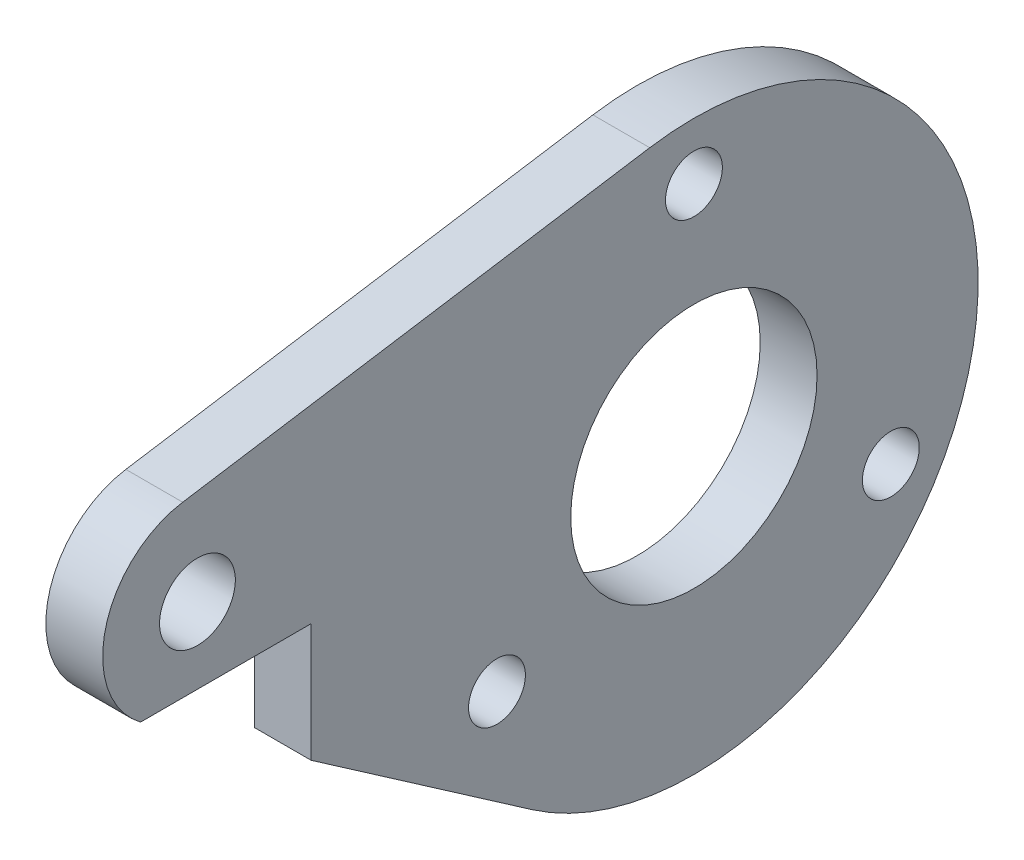
ISO-10303-21;
HEADER;
FILE_DESCRIPTION(('STEP AP214'),'2;1');
FILE_NAME('part.step','',(''),(''),'','','');
FILE_SCHEMA(('AUTOMOTIVE_DESIGN { 1 0 10303 214 1 1 1 1 }'));
ENDSEC;
DATA;
#1=APPLICATION_CONTEXT('core data for automotive mechanical design processes');
#2=APPLICATION_PROTOCOL_DEFINITION('international standard','automotive_design',2000,#1);
#3=PRODUCT_CONTEXT('',#1,'mechanical');
#4=PRODUCT('Part','Part','',(#3));
#5=PRODUCT_RELATED_PRODUCT_CATEGORY('part','',(#4));
#6=PRODUCT_DEFINITION_FORMATION('','',#4);
#7=PRODUCT_DEFINITION_CONTEXT('part definition',#1,'design');
#8=PRODUCT_DEFINITION('design','',#6,#7);
#9=PRODUCT_DEFINITION_SHAPE('','',#8);
#10=(LENGTH_UNIT() NAMED_UNIT(*) SI_UNIT(.MILLI.,.METRE.));
#11=(NAMED_UNIT(*) PLANE_ANGLE_UNIT() SI_UNIT($,.RADIAN.));
#12=(NAMED_UNIT(*) SI_UNIT($,.STERADIAN.) SOLID_ANGLE_UNIT());
#13=UNCERTAINTY_MEASURE_WITH_UNIT(LENGTH_MEASURE(1.E-05),#10,'distance_accuracy_value','');
#14=(GEOMETRIC_REPRESENTATION_CONTEXT(3) GLOBAL_UNCERTAINTY_ASSIGNED_CONTEXT((#13)) GLOBAL_UNIT_ASSIGNED_CONTEXT((#10,
#11,#12)) REPRESENTATION_CONTEXT('',''));
#15=CARTESIAN_POINT('',(0.,0.,0.));
#16=DIRECTION('',(0.,0.,1.));
#17=DIRECTION('',(1.,0.,0.));
#18=AXIS2_PLACEMENT_3D('',#15,#16,#17);
#19=CARTESIAN_POINT('',(3.,5.99999999999995,26.2));
#20=DIRECTION('',(-1.,0.,0.));
#21=DIRECTION('',(0.,0.,1.));
#22=AXIS2_PLACEMENT_3D('',#19,#20,#21);
#23=CYLINDRICAL_SURFACE('',#22,5.);
#24=DIRECTION('',(-1.,0.,0.));
#25=VECTOR('',#24,1.);
#26=CARTESIAN_POINT('',(3.,1.99999999999998,29.2));
#27=LINE('',#26,#25);
#28=CARTESIAN_POINT('',(3.,1.99999999999998,29.2));
#29=VERTEX_POINT('',#28);
#30=CARTESIAN_POINT('',(0.,1.99999999999998,29.2));
#31=VERTEX_POINT('',#30);
#32=EDGE_CURVE('E177',#29,#31,#27,.T.);
#33=ORIENTED_EDGE('',*,*,#32,.F.);
#34=CARTESIAN_POINT('',(3.,5.99999999999995,26.2));
#35=DIRECTION('',(-1.,0.,0.));
#36=DIRECTION('',(0.,0.,-1.));
#37=AXIS2_PLACEMENT_3D('',#34,#35,#36);
#38=CIRCLE('',#37,5.);
#39=CARTESIAN_POINT('',(3.,10.9392142153328,26.9772791873283));
#40=VERTEX_POINT('',#39);
#41=EDGE_CURVE('E90',#29,#40,#38,.T.);
#42=ORIENTED_EDGE('',*,*,#41,.T.);
#43=DIRECTION('',(-1.,0.,0.));
#44=VECTOR('',#43,1.);
#45=CARTESIAN_POINT('',(3.,10.9392142153328,26.9772791873283));
#46=LINE('',#45,#44);
#47=CARTESIAN_POINT('',(0.,10.9392142153328,26.9772791873283));
#48=VERTEX_POINT('',#47);
#49=EDGE_CURVE('E48',#40,#48,#46,.T.);
#50=ORIENTED_EDGE('',*,*,#49,.T.);
#51=CARTESIAN_POINT('',(0.,5.99999999999995,26.2));
#52=DIRECTION('',(-1.,0.,0.));
#53=DIRECTION('',(0.,0.,-1.));
#54=AXIS2_PLACEMENT_3D('',#51,#52,#53);
#55=CIRCLE('',#54,5.);
#56=EDGE_CURVE('E140',#31,#48,#55,.T.);
#57=ORIENTED_EDGE('',*,*,#56,.F.);
#58=EDGE_LOOP('',(#33,#42,#50,#57));
#59=FACE_BOUND('',#58,.T.);
#60=ADVANCED_FACE('F45',(#59),#23,.T.);
#61=CARTESIAN_POINT('',(3.,1.89130458207587,29.0493195613566));
#62=DIRECTION('',(0.,-0.821739083584816,0.569863912271331));
#63=DIRECTION('',(0.,-0.569863912271331,-0.821739083584816));
#64=AXIS2_PLACEMENT_3D('',#61,#62,#63);
#65=PLANE('',#64);
#66=DIRECTION('',(1.,0.,0.));
#67=VECTOR('',#66,1.);
#68=CARTESIAN_POINT('',(0.,-4.24556777426181,20.2));
#69=LINE('',#68,#67);
#70=CARTESIAN_POINT('',(0.,-4.24556777426181,20.2));
#71=VERTEX_POINT('',#70);
#72=CARTESIAN_POINT('',(3.,-4.24556777426181,20.2));
#73=VERTEX_POINT('',#72);
#74=EDGE_CURVE('E110',#71,#73,#69,.T.);
#75=ORIENTED_EDGE('',*,*,#74,.F.);
#76=DIRECTION('',(0.,0.569863912271331,0.821739083584816));
#77=VECTOR('',#76,1.);
#78=CARTESIAN_POINT('',(0.,1.89130458207587,29.0493195613566));
#79=LINE('',#78,#77);
#80=CARTESIAN_POINT('',(0.,-12.3260862537722,8.54795868406996));
#81=VERTEX_POINT('',#80);
#82=EDGE_CURVE('E118',#81,#71,#79,.T.);
#83=ORIENTED_EDGE('',*,*,#82,.F.);
#84=DIRECTION('',(-1.,0.,0.));
#85=VECTOR('',#84,1.);
#86=CARTESIAN_POINT('',(3.,-12.3260862537722,8.54795868406996));
#87=LINE('',#86,#85);
#88=CARTESIAN_POINT('',(3.,-12.3260862537722,8.54795868406996));
#89=VERTEX_POINT('',#88);
#90=EDGE_CURVE('E13',#89,#81,#87,.T.);
#91=ORIENTED_EDGE('',*,*,#90,.F.);
#92=DIRECTION('',(0.,0.569863912271331,0.821739083584816));
#93=VECTOR('',#92,1.);
#94=CARTESIAN_POINT('',(3.,1.89130458207587,29.0493195613566));
#95=LINE('',#94,#93);
#96=EDGE_CURVE('E120',#89,#73,#95,.T.);
#97=ORIENTED_EDGE('',*,*,#96,.T.);
#98=EDGE_LOOP('',(#75,#83,#91,#97));
#99=FACE_BOUND('',#98,.T.);
#100=ADVANCED_FACE('F117',(#99),#65,.T.);
#101=CARTESIAN_POINT('',(3.,0.,0.));
#102=DIRECTION('',(-1.,0.,0.));
#103=DIRECTION('',(0.,0.,1.));
#104=AXIS2_PLACEMENT_3D('',#101,#102,#103);
#105=CYLINDRICAL_SURFACE('',#104,15.);
#106=CARTESIAN_POINT('',(0.,0.,0.));
#107=DIRECTION('',(-1.,0.,0.));
#108=DIRECTION('',(0.,0.,-1.));
#109=AXIS2_PLACEMENT_3D('',#106,#107,#108);
#110=CIRCLE('',#109,15.);
#111=CARTESIAN_POINT('',(0.,14.8176426459986,2.3318375619851));
#112=VERTEX_POINT('',#111);
#113=EDGE_CURVE('E124',#112,#81,#110,.T.);
#114=ORIENTED_EDGE('',*,*,#113,.F.);
#115=DIRECTION('',(-1.,0.,0.));
#116=VECTOR('',#115,1.);
#117=CARTESIAN_POINT('',(3.,14.8176426459986,2.3318375619851));
#118=LINE('',#117,#116);
#119=CARTESIAN_POINT('',(3.,14.8176426459986,2.3318375619851));
#120=VERTEX_POINT('',#119);
#121=EDGE_CURVE('E53',#120,#112,#118,.T.);
#122=ORIENTED_EDGE('',*,*,#121,.F.);
#123=CARTESIAN_POINT('',(3.,0.,0.));
#124=DIRECTION('',(-1.,0.,0.));
#125=DIRECTION('',(0.,0.,-1.));
#126=AXIS2_PLACEMENT_3D('',#123,#124,#125);
#127=CIRCLE('',#126,15.);
#128=EDGE_CURVE('E135',#120,#89,#127,.T.);
#129=ORIENTED_EDGE('',*,*,#128,.T.);
#130=ORIENTED_EDGE('',*,*,#90,.T.);
#131=EDGE_LOOP('',(#114,#122,#129,#130));
#132=FACE_BOUND('',#131,.T.);
#133=ADVANCED_FACE('F201',(#132),#105,.T.);
#134=CARTESIAN_POINT('',(3.,14.8176426459986,2.33183756198509));
#135=DIRECTION('',(0.,0.987842843066571,0.155455837465673));
#136=DIRECTION('',(0.,-0.155455837465673,0.987842843066571));
#137=AXIS2_PLACEMENT_3D('',#134,#135,#136);
#138=PLANE('',#137);
#139=DIRECTION('',(0.,0.155455837465673,-0.987842843066571));
#140=VECTOR('',#139,1.);
#141=CARTESIAN_POINT('',(0.,14.8176426459986,2.33183756198509));
#142=LINE('',#141,#140);
#143=EDGE_CURVE('E128',#48,#112,#142,.T.);
#144=ORIENTED_EDGE('',*,*,#143,.F.);
#145=ORIENTED_EDGE('',*,*,#49,.F.);
#146=DIRECTION('',(0.,0.155455837465673,-0.987842843066571));
#147=VECTOR('',#146,1.);
#148=CARTESIAN_POINT('',(3.,14.8176426459986,2.33183756198509));
#149=LINE('',#148,#147);
#150=EDGE_CURVE('E126',#40,#120,#149,.T.);
#151=ORIENTED_EDGE('',*,*,#150,.T.);
#152=ORIENTED_EDGE('',*,*,#121,.T.);
#153=EDGE_LOOP('',(#144,#145,#151,#152));
#154=FACE_BOUND('',#153,.T.);
#155=ADVANCED_FACE('F142',(#154),#138,.T.);
#156=CARTESIAN_POINT('',(3.,5.99999999999995,26.2));
#157=DIRECTION('',(1.,0.,0.));
#158=DIRECTION('',(0.,0.,-1.));
#159=AXIS2_PLACEMENT_3D('',#156,#157,#158);
#160=PLANE('',#159);
#161=DIRECTION('',(0.,0.,1.));
#162=VECTOR('',#161,1.);
#163=CARTESIAN_POINT('',(3.,1.99999999999998,29.206057461742));
#164=LINE('',#163,#162);
#165=CARTESIAN_POINT('',(3.,1.99999999999998,20.2));
#166=VERTEX_POINT('',#165);
#167=EDGE_CURVE('E115',#166,#29,#164,.T.);
#168=ORIENTED_EDGE('',*,*,#167,.F.);
#169=DIRECTION('',(0.,1.,0.));
#170=VECTOR('',#169,1.);
#171=CARTESIAN_POINT('',(3.,1.99999999999998,20.2));
#172=LINE('',#171,#170);
#173=EDGE_CURVE('E183',#73,#166,#172,.T.);
#174=ORIENTED_EDGE('',*,*,#173,.F.);
#175=ORIENTED_EDGE('',*,*,#96,.F.);
#176=ORIENTED_EDGE('',*,*,#128,.F.);
#177=ORIENTED_EDGE('',*,*,#150,.F.);
#178=ORIENTED_EDGE('',*,*,#41,.F.);
#179=EDGE_LOOP('',(#168,#174,#175,#176,#177,#178));
#180=FACE_BOUND('',#179,.T.);
#181=CARTESIAN_POINT('',(3.,5.99999999999995,26.2));
#182=DIRECTION('',(-1.,0.,0.));
#183=DIRECTION('',(0.,0.,1.));
#184=AXIS2_PLACEMENT_3D('',#181,#182,#183);
#185=CIRCLE('',#184,2.);
#186=CARTESIAN_POINT('',(3.,5.99999999999995,28.2));
#187=VERTEX_POINT('',#186);
#188=EDGE_CURVE('E171',#187,#187,#185,.T.);
#189=ORIENTED_EDGE('',*,*,#188,.T.);
#190=EDGE_LOOP('',(#189));
#191=FACE_BOUND('',#190,.T.);
#192=CARTESIAN_POINT('',(3.,-6.00000000000003,-10.3923048454132));
#193=DIRECTION('',(-1.,0.,0.));
#194=DIRECTION('',(0.,0.,1.));
#195=AXIS2_PLACEMENT_3D('',#192,#193,#194);
#196=CIRCLE('',#195,1.5);
#197=CARTESIAN_POINT('',(3.,-6.00000000000003,-8.89230484541321));
#198=VERTEX_POINT('',#197);
#199=EDGE_CURVE('E165',#198,#198,#196,.T.);
#200=ORIENTED_EDGE('',*,*,#199,.T.);
#201=EDGE_LOOP('',(#200));
#202=FACE_BOUND('',#201,.T.);
#203=CARTESIAN_POINT('',(3.,12.,0.));
#204=DIRECTION('',(-1.,0.,0.));
#205=DIRECTION('',(0.,0.,1.));
#206=AXIS2_PLACEMENT_3D('',#203,#204,#205);
#207=CIRCLE('',#206,1.5);
#208=CARTESIAN_POINT('',(3.,12.,1.5));
#209=VERTEX_POINT('',#208);
#210=EDGE_CURVE('E159',#209,#209,#207,.T.);
#211=ORIENTED_EDGE('',*,*,#210,.T.);
#212=EDGE_LOOP('',(#211));
#213=FACE_BOUND('',#212,.T.);
#214=CARTESIAN_POINT('',(3.,-6.00000000000005,10.3923048454132));
#215=DIRECTION('',(-1.,0.,0.));
#216=DIRECTION('',(0.,0.,1.));
#217=AXIS2_PLACEMENT_3D('',#214,#215,#216);
#218=CIRCLE('',#217,1.5);
#219=CARTESIAN_POINT('',(3.,-6.00000000000005,11.8923048454132));
#220=VERTEX_POINT('',#219);
#221=EDGE_CURVE('E153',#220,#220,#218,.T.);
#222=ORIENTED_EDGE('',*,*,#221,.T.);
#223=EDGE_LOOP('',(#222));
#224=FACE_BOUND('',#223,.T.);
#225=CARTESIAN_POINT('',(3.,0.,0.));
#226=DIRECTION('',(-1.,0.,0.));
#227=DIRECTION('',(0.,0.,1.));
#228=AXIS2_PLACEMENT_3D('',#225,#226,#227);
#229=CIRCLE('',#228,6.5);
#230=CARTESIAN_POINT('',(3.,0.,6.5));
#231=VERTEX_POINT('',#230);
#232=EDGE_CURVE('E141',#231,#231,#229,.T.);
#233=ORIENTED_EDGE('',*,*,#232,.T.);
#234=EDGE_LOOP('',(#233));
#235=FACE_BOUND('',#234,.T.);
#236=ADVANCED_FACE('F147',(#180,#191,#202,#213,#224,#235),#160,.T.);
#237=CARTESIAN_POINT('',(0.,5.99999999999995,26.2));
#238=DIRECTION('',(1.,0.,0.));
#239=DIRECTION('',(0.,0.,-1.));
#240=AXIS2_PLACEMENT_3D('',#237,#238,#239);
#241=PLANE('',#240);
#242=CARTESIAN_POINT('',(0.,5.99999999999995,26.2));
#243=DIRECTION('',(-1.,0.,0.));
#244=DIRECTION('',(0.,0.,1.));
#245=AXIS2_PLACEMENT_3D('',#242,#243,#244);
#246=CIRCLE('',#245,2.);
#247=CARTESIAN_POINT('',(0.,5.99999999999995,28.2));
#248=VERTEX_POINT('',#247);
#249=EDGE_CURVE('E174',#248,#248,#246,.T.);
#250=ORIENTED_EDGE('',*,*,#249,.F.);
#251=EDGE_LOOP('',(#250));
#252=FACE_BOUND('',#251,.T.);
#253=CARTESIAN_POINT('',(0.,-6.00000000000003,-10.3923048454132));
#254=DIRECTION('',(-1.,0.,0.));
#255=DIRECTION('',(0.,0.,1.));
#256=AXIS2_PLACEMENT_3D('',#253,#254,#255);
#257=CIRCLE('',#256,1.5);
#258=CARTESIAN_POINT('',(0.,-6.00000000000003,-8.89230484541321));
#259=VERTEX_POINT('',#258);
#260=EDGE_CURVE('E168',#259,#259,#257,.T.);
#261=ORIENTED_EDGE('',*,*,#260,.F.);
#262=EDGE_LOOP('',(#261));
#263=FACE_BOUND('',#262,.T.);
#264=CARTESIAN_POINT('',(0.,12.,0.));
#265=DIRECTION('',(-1.,0.,0.));
#266=DIRECTION('',(0.,0.,1.));
#267=AXIS2_PLACEMENT_3D('',#264,#265,#266);
#268=CIRCLE('',#267,1.5);
#269=CARTESIAN_POINT('',(0.,12.,1.5));
#270=VERTEX_POINT('',#269);
#271=EDGE_CURVE('E162',#270,#270,#268,.T.);
#272=ORIENTED_EDGE('',*,*,#271,.F.);
#273=EDGE_LOOP('',(#272));
#274=FACE_BOUND('',#273,.T.);
#275=CARTESIAN_POINT('',(0.,-6.00000000000005,10.3923048454132));
#276=DIRECTION('',(-1.,0.,0.));
#277=DIRECTION('',(0.,0.,1.));
#278=AXIS2_PLACEMENT_3D('',#275,#276,#277);
#279=CIRCLE('',#278,1.5);
#280=CARTESIAN_POINT('',(0.,-6.00000000000005,11.8923048454132));
#281=VERTEX_POINT('',#280);
#282=EDGE_CURVE('E156',#281,#281,#279,.T.);
#283=ORIENTED_EDGE('',*,*,#282,.F.);
#284=EDGE_LOOP('',(#283));
#285=FACE_BOUND('',#284,.T.);
#286=CARTESIAN_POINT('',(0.,0.,0.));
#287=DIRECTION('',(-1.,0.,0.));
#288=DIRECTION('',(0.,0.,1.));
#289=AXIS2_PLACEMENT_3D('',#286,#287,#288);
#290=CIRCLE('',#289,6.5);
#291=CARTESIAN_POINT('',(0.,0.,6.5));
#292=VERTEX_POINT('',#291);
#293=EDGE_CURVE('E150',#292,#292,#290,.T.);
#294=ORIENTED_EDGE('',*,*,#293,.F.);
#295=EDGE_LOOP('',(#294));
#296=FACE_BOUND('',#295,.T.);
#297=DIRECTION('',(0.,1.,0.));
#298=VECTOR('',#297,1.);
#299=CARTESIAN_POINT('',(0.,1.99999999999998,20.2));
#300=LINE('',#299,#298);
#301=CARTESIAN_POINT('',(0.,1.99999999999998,20.2));
#302=VERTEX_POINT('',#301);
#303=EDGE_CURVE('E106',#71,#302,#300,.T.);
#304=ORIENTED_EDGE('',*,*,#303,.T.);
#305=DIRECTION('',(0.,0.,1.));
#306=VECTOR('',#305,1.);
#307=CARTESIAN_POINT('',(0.,1.99999999999998,29.206057461742));
#308=LINE('',#307,#306);
#309=EDGE_CURVE('E61',#302,#31,#308,.T.);
#310=ORIENTED_EDGE('',*,*,#309,.T.);
#311=ORIENTED_EDGE('',*,*,#56,.T.);
#312=ORIENTED_EDGE('',*,*,#143,.T.);
#313=ORIENTED_EDGE('',*,*,#113,.T.);
#314=ORIENTED_EDGE('',*,*,#82,.T.);
#315=EDGE_LOOP('',(#304,#310,#311,#312,#313,#314));
#316=FACE_BOUND('',#315,.T.);
#317=ADVANCED_FACE('F122',(#252,#263,#274,#285,#296,#316),#241,.F.);
#318=CARTESIAN_POINT('',(3.,0.,0.));
#319=DIRECTION('',(-1.,0.,0.));
#320=DIRECTION('',(0.,0.,1.));
#321=AXIS2_PLACEMENT_3D('',#318,#319,#320);
#322=CYLINDRICAL_SURFACE('',#321,6.5);
#323=ORIENTED_EDGE('',*,*,#232,.F.);
#324=EDGE_LOOP('',(#323));
#325=FACE_BOUND('',#324,.T.);
#326=ORIENTED_EDGE('',*,*,#293,.T.);
#327=EDGE_LOOP('',(#326));
#328=FACE_BOUND('',#327,.T.);
#329=ADVANCED_FACE('F216',(#325,#328),#322,.F.);
#330=CARTESIAN_POINT('',(3.,-6.00000000000005,10.3923048454132));
#331=DIRECTION('',(-1.,0.,0.));
#332=DIRECTION('',(0.,0.,1.));
#333=AXIS2_PLACEMENT_3D('',#330,#331,#332);
#334=CYLINDRICAL_SURFACE('',#333,1.5);
#335=ORIENTED_EDGE('',*,*,#221,.F.);
#336=EDGE_LOOP('',(#335));
#337=FACE_BOUND('',#336,.T.);
#338=ORIENTED_EDGE('',*,*,#282,.T.);
#339=EDGE_LOOP('',(#338));
#340=FACE_BOUND('',#339,.T.);
#341=ADVANCED_FACE('F221',(#337,#340),#334,.F.);
#342=CARTESIAN_POINT('',(3.,12.,0.));
#343=DIRECTION('',(-1.,0.,0.));
#344=DIRECTION('',(0.,0.,1.));
#345=AXIS2_PLACEMENT_3D('',#342,#343,#344);
#346=CYLINDRICAL_SURFACE('',#345,1.5);
#347=ORIENTED_EDGE('',*,*,#210,.F.);
#348=EDGE_LOOP('',(#347));
#349=FACE_BOUND('',#348,.T.);
#350=ORIENTED_EDGE('',*,*,#271,.T.);
#351=EDGE_LOOP('',(#350));
#352=FACE_BOUND('',#351,.T.);
#353=ADVANCED_FACE('F225',(#349,#352),#346,.F.);
#354=CARTESIAN_POINT('',(3.,-6.00000000000003,-10.3923048454132));
#355=DIRECTION('',(-1.,0.,0.));
#356=DIRECTION('',(0.,0.,1.));
#357=AXIS2_PLACEMENT_3D('',#354,#355,#356);
#358=CYLINDRICAL_SURFACE('',#357,1.5);
#359=ORIENTED_EDGE('',*,*,#199,.F.);
#360=EDGE_LOOP('',(#359));
#361=FACE_BOUND('',#360,.T.);
#362=ORIENTED_EDGE('',*,*,#260,.T.);
#363=EDGE_LOOP('',(#362));
#364=FACE_BOUND('',#363,.T.);
#365=ADVANCED_FACE('F194',(#361,#364),#358,.F.);
#366=CARTESIAN_POINT('',(3.,5.99999999999995,26.2));
#367=DIRECTION('',(-1.,0.,0.));
#368=DIRECTION('',(0.,0.,1.));
#369=AXIS2_PLACEMENT_3D('',#366,#367,#368);
#370=CYLINDRICAL_SURFACE('',#369,2.);
#371=ORIENTED_EDGE('',*,*,#188,.F.);
#372=EDGE_LOOP('',(#371));
#373=FACE_BOUND('',#372,.T.);
#374=ORIENTED_EDGE('',*,*,#249,.T.);
#375=EDGE_LOOP('',(#374));
#376=FACE_BOUND('',#375,.T.);
#377=ADVANCED_FACE('F187',(#373,#376),#370,.F.);
#378=CARTESIAN_POINT('',(0.,1.99999999999998,29.206057461742));
#379=DIRECTION('',(0.,1.,0.));
#380=DIRECTION('',(0.,0.,1.));
#381=AXIS2_PLACEMENT_3D('',#378,#379,#380);
#382=PLANE('',#381);
#383=ORIENTED_EDGE('',*,*,#32,.T.);
#384=ORIENTED_EDGE('',*,*,#309,.F.);
#385=DIRECTION('',(1.,0.,0.));
#386=VECTOR('',#385,1.);
#387=CARTESIAN_POINT('',(0.,1.99999999999998,20.2));
#388=LINE('',#387,#386);
#389=EDGE_CURVE('E112',#302,#166,#388,.T.);
#390=ORIENTED_EDGE('',*,*,#389,.T.);
#391=ORIENTED_EDGE('',*,*,#167,.T.);
#392=EDGE_LOOP('',(#383,#384,#390,#391));
#393=FACE_BOUND('',#392,.T.);
#394=ADVANCED_FACE('F185',(#393),#382,.F.);
#395=CARTESIAN_POINT('',(0.,1.99999999999998,20.2));
#396=DIRECTION('',(0.,0.,-1.));
#397=DIRECTION('',(-1.,0.,0.));
#398=AXIS2_PLACEMENT_3D('',#395,#396,#397);
#399=PLANE('',#398);
#400=ORIENTED_EDGE('',*,*,#173,.T.);
#401=ORIENTED_EDGE('',*,*,#389,.F.);
#402=ORIENTED_EDGE('',*,*,#303,.F.);
#403=ORIENTED_EDGE('',*,*,#74,.T.);
#404=EDGE_LOOP('',(#400,#401,#402,#403));
#405=FACE_BOUND('',#404,.T.);
#406=ADVANCED_FACE('F109',(#405),#399,.F.);
#407=CLOSED_SHELL('',(#60,#100,#133,#155,#236,#317,#329,#341,#353,#365,#377,#394,#406));
#408=MANIFOLD_SOLID_BREP('B2',#407);
#409=ADVANCED_BREP_SHAPE_REPRESENTATION('',(#18,#408),#14);
#410=SHAPE_DEFINITION_REPRESENTATION(#9,#409);
ENDSEC;
END-ISO-10303-21;
